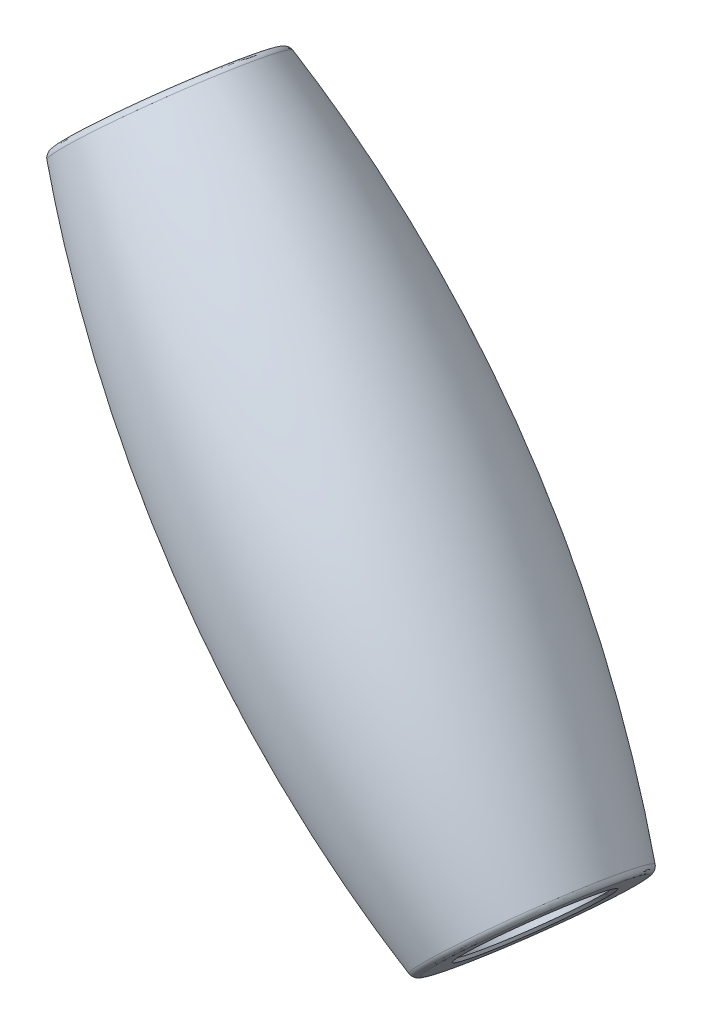
ISO-10303-21;
HEADER;
FILE_DESCRIPTION(('STEP AP214'),'2;1');
FILE_NAME('part.step','',(''),(''),'','','');
FILE_SCHEMA(('AUTOMOTIVE_DESIGN { 1 0 10303 214 1 1 1 1 }'));
ENDSEC;
DATA;
#1=APPLICATION_CONTEXT('core data for automotive mechanical design processes');
#2=APPLICATION_PROTOCOL_DEFINITION('international standard','automotive_design',2000,#1);
#3=PRODUCT_CONTEXT('',#1,'mechanical');
#4=PRODUCT('Part','Part','',(#3));
#5=PRODUCT_RELATED_PRODUCT_CATEGORY('part','',(#4));
#6=PRODUCT_DEFINITION_FORMATION('','',#4);
#7=PRODUCT_DEFINITION_CONTEXT('part definition',#1,'design');
#8=PRODUCT_DEFINITION('design','',#6,#7);
#9=PRODUCT_DEFINITION_SHAPE('','',#8);
#10=(LENGTH_UNIT() NAMED_UNIT(*) SI_UNIT(.MILLI.,.METRE.));
#11=(NAMED_UNIT(*) PLANE_ANGLE_UNIT() SI_UNIT($,.RADIAN.));
#12=(NAMED_UNIT(*) SI_UNIT($,.STERADIAN.) SOLID_ANGLE_UNIT());
#13=UNCERTAINTY_MEASURE_WITH_UNIT(LENGTH_MEASURE(1.E-05),#10,'distance_accuracy_value','');
#14=(GEOMETRIC_REPRESENTATION_CONTEXT(3) GLOBAL_UNCERTAINTY_ASSIGNED_CONTEXT((#13)) GLOBAL_UNIT_ASSIGNED_CONTEXT((#10,
#11,#12)) REPRESENTATION_CONTEXT('',''));
#15=CARTESIAN_POINT('',(0.,0.,0.));
#16=DIRECTION('',(0.,0.,1.));
#17=DIRECTION('',(1.,0.,0.));
#18=AXIS2_PLACEMENT_3D('',#15,#16,#17);
#19=CARTESIAN_POINT('',(23.35400207298,6.307790411449,-36.77943866619));
#20=DIRECTION('',(-0.69636424032003,0.707106781186531,-0.122787803969005));
#21=DIRECTION('',(-0.712498293208656,-0.701673843159878,0.));
#22=AXIS2_PLACEMENT_3D('',#19,#20,#21);
#23=CYLINDRICAL_SURFACE('',#22,2.75);
#24=CARTESIAN_POINT('',(20.4989086876672,9.20692821431447,-37.282868662463));
#25=DIRECTION('',(-0.69636424032003,0.707106781186531,-0.122787803969005));
#26=DIRECTION('',(-0.712498293208656,-0.701673843159878,0.));
#27=AXIS2_PLACEMENT_3D('',#24,#25,#26);
#28=CIRCLE('',#27,2.75);
#29=CARTESIAN_POINT('',(18.5395383813434,7.27732514562481,-37.282868662463));
#30=VERTEX_POINT('',#29);
#31=EDGE_CURVE('E94',#30,#30,#28,.T.);
#32=ORIENTED_EDGE('',*,*,#31,.F.);
#33=EDGE_LOOP('',(#32));
#34=FACE_BOUND('',#33,.T.);
#35=CARTESIAN_POINT('',(-6.52002383675149,36.6426713243534,-42.0470354564607));
#36=DIRECTION('',(-0.69636424032003,0.707106781186531,-0.122787803969005));
#37=DIRECTION('',(-0.712498293208656,-0.701673843159878,0.));
#38=AXIS2_PLACEMENT_3D('',#35,#36,#37);
#39=CIRCLE('',#38,2.75);
#40=CARTESIAN_POINT('',(-8.4793941430753,34.7130682556637,-42.0470354564607));
#41=VERTEX_POINT('',#40);
#42=EDGE_CURVE('E91',#41,#41,#39,.F.);
#43=ORIENTED_EDGE('',*,*,#42,.F.);
#44=EDGE_LOOP('',(#43));
#45=FACE_BOUND('',#44,.T.);
#46=ADVANCED_FACE('F16',(#34,#45),#23,.F.);
#47=CARTESIAN_POINT('',(20.49890868767,9.206928214314,-37.28286866247));
#48=DIRECTION('',(0.69636424032003,-0.707106781186531,0.122787803969005));
#49=DIRECTION('',(0.712498293208656,0.701673843159878,0.));
#50=AXIS2_PLACEMENT_3D('',#47,#48,#49);
#51=PLANE('',#50);
#52=ORIENTED_EDGE('',*,*,#31,.T.);
#53=EDGE_LOOP('',(#52));
#54=FACE_BOUND('',#53,.T.);
#55=CARTESIAN_POINT('',(20.4989086876644,9.20692821431726,-37.2828686624635));
#56=DIRECTION('',(0.69636424032003,-0.707106781186531,0.122787803969005));
#57=DIRECTION('',(0.712498293208656,0.701673843159878,0.));
#58=AXIS2_PLACEMENT_3D('',#55,#56,#57);
#59=CIRCLE('',#58,4.5);
#60=CARTESIAN_POINT('',(23.7051510071034,12.3644605085367,-37.2828686624635));
#61=VERTEX_POINT('',#60);
#62=EDGE_CURVE('E88',#61,#61,#59,.T.);
#63=ORIENTED_EDGE('',*,*,#62,.T.);
#64=EDGE_LOOP('',(#63));
#65=FACE_BOUND('',#64,.T.);
#66=ADVANCED_FACE('F214',(#54,#65),#51,.T.);
#67=CARTESIAN_POINT('',(-6.520023836751,36.64267132435,-42.04703545646));
#68=DIRECTION('',(-0.69636424032003,0.707106781186531,-0.122787803969005));
#69=DIRECTION('',(-0.712498293208656,-0.701673843159878,0.));
#70=AXIS2_PLACEMENT_3D('',#67,#68,#69);
#71=PLANE('',#70);
#72=ORIENTED_EDGE('',*,*,#42,.T.);
#73=EDGE_LOOP('',(#72));
#74=FACE_BOUND('',#73,.T.);
#75=CARTESIAN_POINT('',(-6.520023836748,36.6426713243523,-42.0470354564666));
#76=DIRECTION('',(-0.69636424032003,0.707106781186531,-0.122787803969005));
#77=DIRECTION('',(-0.712498293208656,-0.701673843159878,0.));
#78=AXIS2_PLACEMENT_3D('',#75,#76,#77);
#79=CIRCLE('',#78,4.5);
#80=CARTESIAN_POINT('',(-9.72626615618695,33.4851390301328,-42.0470354564666));
#81=VERTEX_POINT('',#80);
#82=EDGE_CURVE('E85',#81,#81,#79,.T.);
#83=ORIENTED_EDGE('',*,*,#82,.T.);
#84=EDGE_LOOP('',(#83));
#85=FACE_BOUND('',#84,.T.);
#86=ADVANCED_FACE('F204',(#74,#85),#71,.T.);
#87=CARTESIAN_POINT('',(23.35400207298,6.307790411449,-36.77943866619));
#88=DIRECTION('',(0.69636424032003,-0.707106781186531,0.122787803969005));
#89=DIRECTION('',(0.712498293208656,0.701673843159878,0.));
#90=AXIS2_PLACEMENT_3D('',#87,#88,#89);
#91=CYLINDRICAL_SURFACE('',#90,4.5);
#92=ORIENTED_EDGE('',*,*,#62,.F.);
#93=EDGE_LOOP('',(#92));
#94=FACE_BOUND('',#93,.T.);
#95=CARTESIAN_POINT('',(23.2147292248807,6.4492117677169,-36.8039962269907));
#96=DIRECTION('',(0.69636424032003,-0.707106781186531,0.122787803969005));
#97=DIRECTION('',(0.0861569903046802,-0.0874861007541778,-0.992432947456134));
#98=AXIS2_PLACEMENT_3D('',#95,#96,#97);
#99=CIRCLE('',#98,4.50000000003672);
#100=CARTESIAN_POINT('',(23.9961460243775,6.44921176771164,-41.2356311155543));
#101=VERTEX_POINT('',#100);
#102=CARTESIAN_POINT('',(22.4333124252791,6.44921176782527,-32.3723613385272));
#103=VERTEX_POINT('',#102);
#104=EDGE_CURVE('E73',#101,#103,#99,.T.);
#105=ORIENTED_EDGE('',*,*,#104,.T.);
#106=CARTESIAN_POINT('',(23.2147292248807,6.4492117677169,-36.8039962269907));
#107=DIRECTION('',(0.69636424032003,-0.707106781186531,0.122787803969005));
#108=DIRECTION('',(0.0861569903046802,-0.0874861007541778,-0.992432947456134));
#109=AXIS2_PLACEMENT_3D('',#106,#107,#108);
#110=CIRCLE('',#109,4.50000000003672);
#111=EDGE_CURVE('E75',#103,#101,#110,.T.);
#112=ORIENTED_EDGE('',*,*,#111,.T.);
#113=EDGE_LOOP('',(#105,#112));
#114=FACE_BOUND('',#113,.T.);
#115=ADVANCED_FACE('F201',(#94,#114),#91,.F.);
#116=CARTESIAN_POINT('',(-9.375117222063,39.54180912722,-42.55046545274));
#117=DIRECTION('',(-0.69636424032003,0.707106781186531,-0.122787803969005));
#118=DIRECTION('',(-0.712498293208656,-0.701673843159878,0.));
#119=AXIS2_PLACEMENT_3D('',#116,#117,#118);
#120=CYLINDRICAL_SURFACE('',#119,4.5);
#121=ORIENTED_EDGE('',*,*,#82,.F.);
#122=EDGE_LOOP('',(#121));
#123=FACE_BOUND('',#122,.T.);
#124=CARTESIAN_POINT('',(-9.23584437399312,39.4003877709689,-42.5259078919436));
#125=DIRECTION('',(-0.69636424032003,0.707106781186531,-0.122787803969005));
#126=DIRECTION('',(0.0861569903103945,-0.08748610074855,-0.992432947456134));
#127=AXIS2_PLACEMENT_3D('',#124,#125,#126);
#128=CIRCLE('',#127,4.50000000000432);
#129=CARTESIAN_POINT('',(-8.84813791759598,39.0067003176,-46.9918561555005));
#130=VERTEX_POINT('',#129);
#131=EDGE_CURVE('E68',#130,#130,#128,.T.);
#132=ORIENTED_EDGE('',*,*,#131,.T.);
#133=EDGE_LOOP('',(#132));
#134=FACE_BOUND('',#133,.T.);
#135=ADVANCED_FACE('F203',(#123,#134),#120,.F.);
#136=CARTESIAN_POINT('',(23.3540020728644,6.30779041156115,-36.7794386662111));
#137=DIRECTION('',(0.69636424032003,-0.707106781186531,0.122787803969006));
#138=DIRECTION('',(0.712498293208656,0.701673843159877,0.));
#139=AXIS2_PLACEMENT_3D('',#136,#137,#138);
#140=CONICAL_SURFACE('',#139,4.69999999988672,0.785398163364955);
#141=ORIENTED_EDGE('',*,*,#104,.F.);
#142=DIRECTION('',(-0.615191680475335,0.499999999999894,0.60954015148638));
#143=VECTOR('',#142,1.);
#144=CARTESIAN_POINT('',(499193.449873884,-405695.927437788,-494625.011873929));
#145=LINE('',#144,#143);
#146=CARTESIAN_POINT('',(24.1701485079852,6.30779041147593,-41.4080351053603));
#147=VERTEX_POINT('',#146);
#148=EDGE_CURVE('E71',#101,#147,#145,.F.);
#149=ORIENTED_EDGE('',*,*,#148,.T.);
#150=CARTESIAN_POINT('',(23.3540020729642,6.30779041145988,-36.7794386661935));
#151=DIRECTION('',(0.69636424032003,-0.707106781186531,0.122787803969006));
#152=DIRECTION('',(0.712498293208656,0.701673843159877,0.));
#153=AXIS2_PLACEMENT_3D('',#150,#151,#152);
#154=CIRCLE('',#153,4.70000000002994);
#155=CARTESIAN_POINT('',(22.537855637905,6.3077904114617,-32.1508422269821));
#156=VERTEX_POINT('',#155);
#157=EDGE_CURVE('E62',#156,#147,#154,.F.);
#158=ORIENTED_EDGE('',*,*,#157,.F.);
#159=DIRECTION('',(-0.369616072538232,0.499999999999016,-0.783188329153593));
#160=VECTOR('',#159,1.);
#161=CARTESIAN_POINT('',(299930.671465759,-405695.927437075,635450.36064241));
#162=LINE('',#161,#160);
#163=EDGE_CURVE('E57',#156,#103,#162,.T.);
#164=ORIENTED_EDGE('',*,*,#163,.T.);
#165=EDGE_LOOP('',(#141,#149,#158,#164));
#166=FACE_BOUND('',#165,.T.);
#167=ADVANCED_FACE('F72',(#166),#140,.F.);
#168=CARTESIAN_POINT('',(23.3540020728644,6.30779041156115,-36.7794386662111));
#169=DIRECTION('',(0.69636424032003,-0.707106781186531,0.122787803969006));
#170=DIRECTION('',(0.712498293208656,0.701673843159877,0.));
#171=AXIS2_PLACEMENT_3D('',#168,#169,#170);
#172=CONICAL_SURFACE('',#171,4.69999999988672,0.78539816334867);
#173=ORIENTED_EDGE('',*,*,#111,.F.);
#174=ORIENTED_EDGE('',*,*,#163,.F.);
#175=CARTESIAN_POINT('',(23.3540020729496,6.30779041147463,-36.7794386661961));
#176=DIRECTION('',(0.69636424032003,-0.707106781186531,0.122787803969006));
#177=DIRECTION('',(0.712498293208656,0.701673843159877,0.));
#178=AXIS2_PLACEMENT_3D('',#175,#176,#177);
#179=CIRCLE('',#178,4.70000000000907);
#180=EDGE_CURVE('E66',#147,#156,#179,.F.);
#181=ORIENTED_EDGE('',*,*,#180,.F.);
#182=ORIENTED_EDGE('',*,*,#148,.F.);
#183=EDGE_LOOP('',(#173,#174,#181,#182));
#184=FACE_BOUND('',#183,.T.);
#185=ADVANCED_FACE('F77',(#184),#172,.F.);
#186=CARTESIAN_POINT('',(-9.37511722202455,39.5418091271731,-42.5504654527317));
#187=DIRECTION('',(-0.69636424032003,0.707106781186531,-0.122787803969005));
#188=DIRECTION('',(-0.712498293208656,-0.701673843159878,0.));
#189=AXIS2_PLACEMENT_3D('',#186,#187,#188);
#190=CONICAL_SURFACE('',#189,4.69999999995667,0.785398163418359);
#191=ORIENTED_EDGE('',*,*,#131,.F.);
#192=EDGE_LOOP('',(#191));
#193=FACE_BOUND('',#192,.T.);
#194=CARTESIAN_POINT('',(-9.37511722206042,39.5418091272095,-42.550465452738));
#195=DIRECTION('',(-0.69636424032003,0.707106781186531,-0.122787803969005));
#196=DIRECTION('',(-0.712498293208656,-0.701673843159878,0.));
#197=AXIS2_PLACEMENT_3D('',#194,#195,#196);
#198=CIRCLE('',#197,4.70000000000819);
#199=CARTESIAN_POINT('',(-12.7238592001469,36.2439420643523,-42.550465452738));
#200=VERTEX_POINT('',#199);
#201=EDGE_CURVE('E78',#200,#200,#198,.T.);
#202=ORIENTED_EDGE('',*,*,#201,.T.);
#203=EDGE_LOOP('',(#202));
#204=FACE_BOUND('',#203,.T.);
#205=ADVANCED_FACE('F263',(#193,#204),#190,.F.);
#206=CARTESIAN_POINT('',(23.35400207298,6.307790411449,-36.77943866619));
#207=DIRECTION('',(0.69636424032003,-0.707106781186531,0.122787803969005));
#208=DIRECTION('',(0.712498293208656,0.701673843159878,0.));
#209=AXIS2_PLACEMENT_3D('',#206,#207,#208);
#210=PLANE('',#209);
#211=ORIENTED_EDGE('',*,*,#157,.T.);
#212=ORIENTED_EDGE('',*,*,#180,.T.);
#213=EDGE_LOOP('',(#211,#212));
#214=FACE_BOUND('',#213,.T.);
#215=CARTESIAN_POINT('',(22.22674071889,6.30779041144502,-30.38642184281));
#216=CARTESIAN_POINT('',(22.3007076558877,6.38289880496775,-30.3733771882028));
#217=CARTESIAN_POINT('',(22.3751279307511,6.45800706292176,-30.3629043211006));
#218=CARTESIAN_POINT('',(22.5246944918361,6.60804270897069,-30.3471175899189));
#219=CARTESIAN_POINT('',(22.5998407780577,6.68297009706561,-30.3418037258394));
#220=CARTESIAN_POINT('',(22.7506786974862,6.83246340467471,-30.3363504287164));
#221=CARTESIAN_POINT('',(22.826370330693,6.90702932418888,-30.3362109956728));
#222=CARTESIAN_POINT('',(22.9781164972803,7.05562008347817,-30.341106192773));
#223=CARTESIAN_POINT('',(23.0541710306608,7.12964492325329,-30.3461408229167));
#224=CARTESIAN_POINT('',(23.2064598020998,7.27697518413051,-30.3613722060972));
#225=CARTESIAN_POINT('',(23.2826940401584,7.35028060523263,-30.3715689591339));
#226=CARTESIAN_POINT('',(23.4351585588862,7.49599543135506,-30.3970999727016));
#227=CARTESIAN_POINT('',(23.5113888395555,7.56840483637539,-30.4124342332327));
#228=CARTESIAN_POINT('',(23.663661799987,7.71215318926058,-30.4482033337513));
#229=CARTESIAN_POINT('',(23.7397044797491,7.78349213712545,-30.4686381737388));
#230=CARTESIAN_POINT('',(23.8914190443797,7.92492771405295,-30.5145592002231));
#231=CARTESIAN_POINT('',(23.9670909292482,7.99502434311558,-30.5400453867199));
#232=CARTESIAN_POINT('',(24.1178816040294,8.13380641348539,-30.5960077087392));
#233=CARTESIAN_POINT('',(24.1930003939422,8.20249185479257,-30.6264838442618));
#234=CARTESIAN_POINT('',(24.3425039110309,8.33828608041634,-30.6923526443923));
#235=CARTESIAN_POINT('',(24.4168886382068,8.40539486473293,-30.7277453090002));
#236=CARTESIAN_POINT('',(24.5647448305085,8.53787410543365,-30.8033619033423));
#237=CARTESIAN_POINT('',(24.6382162956343,8.60324456181777,-30.8435858330764));
#238=CARTESIAN_POINT('',(24.7840689646383,8.73208966349899,-30.9287680546821));
#239=CARTESIAN_POINT('',(24.8564501685165,8.79556430879609,-30.9737263465537));
#240=CARTESIAN_POINT('',(24.9999479423661,8.92046487232284,-31.0682689839764));
#241=CARTESIAN_POINT('',(25.0710645123374,8.98189079055249,-31.1178533295275));
#242=CARTESIAN_POINT('',(25.2118616923269,9.10254591952712,-31.2215286212764));
#243=CARTESIAN_POINT('',(25.281542302345,9.16177513027208,-31.2756195674742));
#244=CARTESIAN_POINT('',(25.4192996957353,9.27789415592076,-31.3881777506896));
#245=CARTESIAN_POINT('',(25.4873764791075,9.33478397082447,-31.4466449877072));
#246=CARTESIAN_POINT('',(25.6217622162719,9.44608715224359,-31.567814899867));
#247=CARTESIAN_POINT('',(25.6880711700641,9.500500518759,-31.6305175750093));
#248=CARTESIAN_POINT('',(25.8187615039909,9.60671971683551,-31.7600073071819));
#249=CARTESIAN_POINT('',(25.8831428841255,9.65852554839662,-31.8267943642123));
#250=CARTESIAN_POINT('',(26.0098229703532,9.75940487177866,-31.9642919642909));
#251=CARTESIAN_POINT('',(26.0721216764463,9.80847836359959,-32.0350025073392));
#252=CARTESIAN_POINT('',(26.1944863315512,9.90377478516114,-32.1801767315618));
#253=CARTESIAN_POINT('',(26.2545522805631,9.94999771490176,-32.2546404127363));
#254=CARTESIAN_POINT('',(26.3723067173733,10.0394816572163,-32.4071415236811));
#255=CARTESIAN_POINT('',(26.4299952051717,10.0827426697902,-32.4851789534515));
#256=CARTESIAN_POINT('',(26.5428557429348,10.1661985582029,-32.6446395625847));
#257=CARTESIAN_POINT('',(26.5980277928996,10.2063934340416,-32.7260627419474));
#258=CARTESIAN_POINT('',(26.7057225406948,10.2836202160072,-32.8920986946945));
#259=CARTESIAN_POINT('',(26.7582452385251,10.3206521221342,-32.9767114680787));
#260=CARTESIAN_POINT('',(26.8605147502719,10.3914637515708,-33.1489227692864));
#261=CARTESIAN_POINT('',(26.9102615641884,10.4252434748805,-33.2365212971098));
#262=CARTESIAN_POINT('',(27.0068594636753,10.4894693603705,-33.4144930746696));
#263=CARTESIAN_POINT('',(27.0537105492457,10.5199155225508,-33.504866324406));
#264=CARTESIAN_POINT('',(27.1444041236719,10.5774009383104,-33.6881698287173));
#265=CARTESIAN_POINT('',(27.1882466125276,10.6044401918898,-33.7811000832922));
#266=CARTESIAN_POINT('',(27.2728173731284,10.6550466505174,-33.9692937201576));
#267=CARTESIAN_POINT('',(27.3135456448735,10.6786138555657,-34.0645571024481));
#268=CARTESIAN_POINT('',(27.3917898532791,10.7222194416698,-34.2571874969125));
#269=CARTESIAN_POINT('',(27.4293057899396,10.7422578227257,-34.3545545090865));
#270=CARTESIAN_POINT('',(27.5010349489986,10.77875748663,-34.5511575976574));
#271=CARTESIAN_POINT('',(27.5352481713971,10.7952187694785,-34.6503936740543));
#272=CARTESIAN_POINT('',(27.6002894792827,10.8245245802957,-34.8504958226708));
#273=CARTESIAN_POINT('',(27.6311175647697,10.8373691082644,-34.9513618948904));
#274=CARTESIAN_POINT('',(27.689314331274,10.8594104657294,-35.1544810399496));
#275=CARTESIAN_POINT('',(27.7166830122914,10.8686072952255,-35.2567341127892));
#276=CARTESIAN_POINT('',(27.7678950363066,10.8833310997775,-35.4623809224795));
#277=CARTESIAN_POINT('',(27.7917383793045,10.8888580748332,-35.5657746593303));
#278=CARTESIAN_POINT('',(27.8358422865792,10.8962288555373,-35.7734537124747));
#279=CARTESIAN_POINT('',(27.856102850856,10.8980726611857,-35.8777390287684));
#280=CARTESIAN_POINT('',(27.8929923912144,10.8980726611856,-36.0869500083373));
#281=CARTESIAN_POINT('',(27.909621367296,10.8962288555372,-36.1918756716126));
#282=CARTESIAN_POINT('',(27.9392076706043,10.888858074833,-36.4021145700315));
#283=CARTESIAN_POINT('',(27.952164997831,10.8833310997772,-36.5074278051751));
#284=CARTESIAN_POINT('',(27.974376788093,10.8686072952252,-36.718188138523));
#285=CARTESIAN_POINT('',(27.9836312511284,10.859410465729,-36.8236352367273));
#286=CARTESIAN_POINT('',(27.9984150181959,10.837369108264,-37.0344092649006));
#287=CARTESIAN_POINT('',(28.003944322228,10.8245245802952,-37.1397361948698));
#288=CARTESIAN_POINT('',(28.0112644507112,10.7952187694779,-37.3500161447732));
#289=CARTESIAN_POINT('',(28.0130552751624,10.7787574866294,-37.4549691647074));
#290=CARTESIAN_POINT('',(28.0128941302306,10.7422578227249,-37.6642484535231));
#291=CARTESIAN_POINT('',(28.0109421608478,10.722219441669,-37.7685747224046));
#292=CARTESIAN_POINT('',(28.0033001307133,10.6786138555648,-37.9763491779952));
#293=CARTESIAN_POINT('',(27.9976100699617,10.6550466505165,-38.0797973647043));
#294=CARTESIAN_POINT('',(27.9825055649445,10.6044401918888,-38.2855664402074));
#295=CARTESIAN_POINT('',(27.9730911206789,10.5774009383094,-38.3878873290014));
#296=CARTESIAN_POINT('',(27.9505605288545,10.5199155225497,-38.5911553086908));
#297=CARTESIAN_POINT('',(27.9374443812957,10.4894693603694,-38.6921023995862));
#298=CARTESIAN_POINT('',(27.9075419808333,10.4252434748793,-38.8923795930947));
#299=CARTESIAN_POINT('',(27.8907557279297,10.3914637515695,-38.9917096957078));
#300=CARTESIAN_POINT('',(27.8535535563311,10.3206521221328,-39.188513617734));
#301=CARTESIAN_POINT('',(27.8331376376362,10.2836202160058,-39.2859874371472));
#302=CARTESIAN_POINT('',(27.7887253181913,10.2063934340401,-39.4788439698049));
#303=CARTESIAN_POINT('',(27.7647289174414,10.1661985582014,-39.5742266830496));
#304=CARTESIAN_POINT('',(27.713213443318,10.0827426697887,-39.7626712180595));
#305=CARTESIAN_POINT('',(27.6856943699444,10.0394816572147,-39.8557330398248));
#306=CARTESIAN_POINT('',(27.6271998464316,9.94999771490012,-40.0393115977963));
#307=CARTESIAN_POINT('',(27.5962243962924,9.90377478515947,-40.1298283340025));
#308=CARTESIAN_POINT('',(27.5308917418211,9.80847836359786,-40.3080986581097));
#309=CARTESIAN_POINT('',(27.4965345374888,9.7594048717769,-40.3958522460109));
#310=CARTESIAN_POINT('',(27.4245211441459,9.65852554839481,-40.5683848674285));
#311=CARTESIAN_POINT('',(27.3868649551353,9.60671971683368,-40.6531639009451));
#312=CARTESIAN_POINT('',(27.308344309493,9.50050051875712,-40.819543173476));
#313=CARTESIAN_POINT('',(27.2674798528615,9.4460871522417,-40.9011434124904));
#314=CARTESIAN_POINT('',(27.1826411180329,9.33478397082254,-41.0609685138941));
#315=CARTESIAN_POINT('',(27.1386668398358,9.27789415591881,-41.1391933762833));
#316=CARTESIAN_POINT('',(27.047714399764,9.1617751302701,-41.2920792738913));
#317=CARTESIAN_POINT('',(27.0007362378892,9.10254591952511,-41.3667403091101));
#318=CARTESIAN_POINT('',(26.9038892049689,8.98189079055047,-41.5123186874041));
#319=CARTESIAN_POINT('',(26.8540203339233,8.92046487232081,-41.5832360304793));
#320=CARTESIAN_POINT('',(26.7515120211394,8.79556430879404,-41.7211561783939));
#321=CARTESIAN_POINT('',(26.698872579401,8.73208966349693,-41.7881589832332));
#322=CARTESIAN_POINT('',(26.5909499382583,8.6032445618157,-41.9180886390553));
#323=CARTESIAN_POINT('',(26.5356667388541,8.53787410543157,-41.981015490038));
#324=CARTESIAN_POINT('',(26.4225897644453,8.40539486473085,-42.1026416418327));
#325=CARTESIAN_POINT('',(26.3647959894408,8.33828608041425,-42.1613409426446));
#326=CARTESIAN_POINT('',(26.2468370941123,8.20249185479048,-42.2743705824095));
#327=CARTESIAN_POINT('',(26.1866719737883,8.13380641348331,-42.3287009213625));
#328=CARTESIAN_POINT('',(26.064115330811,7.9950243431135,-42.4328617506068));
#329=CARTESIAN_POINT('',(26.0017238081576,7.92492771405087,-42.4826922408982));
#330=CARTESIAN_POINT('',(25.8748646673683,7.78349213712339,-42.5777333277638));
#331=CARTESIAN_POINT('',(25.8103970492324,7.71215318925853,-42.622943924338));
#332=CARTESIAN_POINT('',(25.6795410248557,7.56840483637336,-42.7086363038987));
#333=CARTESIAN_POINT('',(25.613152618615,7.49599543135305,-42.7491180868852));
#334=CARTESIAN_POINT('',(25.4786149563544,7.35028060523064,-42.8252553284832));
#335=CARTESIAN_POINT('',(25.4104657003346,7.27697518412854,-42.8609107870949));
#336=CARTESIAN_POINT('',(25.2725705054433,7.12964492325135,-42.9273094329082));
#337=CARTESIAN_POINT('',(25.2028245665717,7.05562008347626,-42.95805262011));
#338=CARTESIAN_POINT('',(25.0619040696109,6.90702932418701,-43.0145528463475));
#339=CARTESIAN_POINT('',(24.9907295115217,6.83246340467286,-43.0403098853832));
#340=CARTESIAN_POINT('',(24.8471230942365,6.68297009706381,-43.0867750691394));
#341=CARTESIAN_POINT('',(24.7746912350405,6.60804270896892,-43.10748321386));
#342=CARTESIAN_POINT('',(24.6287452612112,6.45800706292005,-43.1438033157211));
#343=CARTESIAN_POINT('',(24.5552311465779,6.38289880496606,-43.1594152728617));
#344=CARTESIAN_POINT('',(24.4812634270606,6.30779041144336,-43.1724554895799));
#345=B_SPLINE_CURVE_WITH_KNOTS('',3,(#215,#216,#217,#218,#219,#220,#221,#222,#223,#224,#225,
#226,#227,#228,#229,#230,#231,#232,#233,#234,#235,#236,#237,#238,#239,#240,#241,#242,#243,#244,
#245,#246,#247,#248,#249,#250,#251,#252,#253,#254,#255,#256,#257,#258,#259,#260,#261,#262,#263,
#264,#265,#266,#267,#268,#269,#270,#271,#272,#273,#274,#275,#276,#277,#278,#279,#280,#281,#282,
#283,#284,#285,#286,#287,#288,#289,#290,#291,#292,#293,#294,#295,#296,#297,#298,#299,#300,#301,
#302,#303,#304,#305,#306,#307,#308,#309,#310,#311,#312,#313,#314,#315,#316,#317,#318,#319,#320,
#321,#322,#323,#324,#325,#326,#327,#328,#329,#330,#331,#332,#333,#334,#335,#336,#337,#338,#339,
#340,#341,#342,#343,#344),.UNSPECIFIED.,.F.,.F.,(4,2,2,2,2,2,2,2,2,2,2,2,2,2,2,2,2,2,2,2,2,2,2,
2,2,2,2,2,2,2,2,2,2,2,2,2,2,2,2,2,2,2,2,2,2,2,2,2,2,2,2,2,2,2,2,2,2,2,2,2,2,2,2,2,4),(0.,
0.318625612631008,0.637251225262015,0.955876837893021,1.27450245052403,1.59312806315503,
1.91175367578603,2.23037928841702,2.54900490104802,2.86763051367901,3.18625612631001,
3.50488173894099,3.82350735157198,4.14213296420296,4.46075857683395,4.77938418946493,
5.09800980209591,5.41663541472688,5.73526102735786,6.05388663998883,6.37251225261979,
6.69113786525077,7.00976347788173,7.3283890905127,7.64701470314366,7.96564031577462,
8.28426592840558,8.60289154103653,8.92151715366749,9.24014276629844,9.55876837892939,
9.87739399156033,10.1960196041913,10.5146452168222,10.8332708294532,11.1518964420841,
11.470522054715,11.789147667346,12.1077732799769,12.4263988926078,12.7450245052388,
13.0636501178697,13.3822757305006,13.7009013431315,14.0195269557625,14.3381525683934,
14.6567781810243,14.9754037936552,15.2940294062861,15.612655018917,15.9312806315479,
16.2499062441788,16.5685318568097,16.8871574694406,17.2057830820715,17.5244086947024,
17.8430343073333,18.1616599199642,18.4802855325951,18.798911145226,19.1175367578569,
19.4361623704878,19.7547879831187,20.0734135957495,20.3920392083804),.UNSPECIFIED.);
#346=CARTESIAN_POINT('',(22.2267407194853,6.30779041204929,-30.3864218427051));
#347=VERTEX_POINT('',#346);
#348=CARTESIAN_POINT('',(24.4812634266426,6.30779041101835,-43.1724554896552));
#349=VERTEX_POINT('',#348);
#350=EDGE_CURVE('E81',#347,#349,#345,.T.);
#351=ORIENTED_EDGE('',*,*,#350,.F.);
#352=CARTESIAN_POINT('',(23.35400207298,6.30779041144873,-36.7794386661955));
#353=DIRECTION('',(-0.69636424032003,0.707106781186531,-0.122787803969005));
#354=DIRECTION('',(0.17364817750502,-1.64450605373756E-10,-0.984807753040757));
#355=AXIS2_PLACEMENT_3D('',#352,#353,#354);
#356=CIRCLE('',#355,6.49163941269943);
#357=EDGE_CURVE('E170',#349,#347,#356,.T.);
#358=ORIENTED_EDGE('',*,*,#357,.F.);
#359=EDGE_LOOP('',(#351,#358));
#360=FACE_BOUND('',#359,.T.);
#361=ADVANCED_FACE('F64',(#214,#360),#210,.T.);
#362=CARTESIAN_POINT('',(-9.375117222063,39.54180912722,-42.55046545274));
#363=DIRECTION('',(0.69636424032003,-0.707106781186531,0.122787803969005));
#364=DIRECTION('',(0.712498293208656,0.701673843159878,0.));
#365=AXIS2_PLACEMENT_3D('',#362,#363,#364);
#366=PLANE('',#365);
#367=ORIENTED_EDGE('',*,*,#201,.F.);
#368=EDGE_LOOP('',(#367));
#369=FACE_BOUND('',#368,.T.);
#370=CARTESIAN_POINT('',(-9.37511722206302,39.5418091272133,-42.5504654527345));
#371=DIRECTION('',(0.69636424032003,-0.707106781186531,0.122787803969005));
#372=DIRECTION('',(-0.173648177180735,4.93738158280425E-10,0.984807753097937));
#373=AXIS2_PLACEMENT_3D('',#370,#371,#372);
#374=CIRCLE('',#373,6.48880490282299);
#375=CARTESIAN_POINT('',(-10.5018863674109,39.5418091284998,-36.1602400764276));
#376=VERTEX_POINT('',#375);
#377=CARTESIAN_POINT('',(-8.2483480754498,39.5418091272177,-48.9406908288189));
#378=VERTEX_POINT('',#377);
#379=EDGE_CURVE('E35',#376,#378,#374,.T.);
#380=ORIENTED_EDGE('',*,*,#379,.F.);
#381=CARTESIAN_POINT('',(-8.24834807544818,39.5418091272161,-48.9406908288193));
#382=CARTESIAN_POINT('',(-8.17441265320113,39.6168847254047,-48.9276563059821));
#383=CARTESIAN_POINT('',(-8.10093063777595,39.6919601880838,-48.9120511656473));
#384=CARTESIAN_POINT('',(-7.9550483898068,39.8419303225578,-48.8757469225976));
#385=CARTESIAN_POINT('',(-7.88264815726284,39.9168249943528,-48.8550478198826));
#386=CARTESIAN_POINT('',(-7.73910444429364,40.0662530271937,-48.8086029246869));
#387=CARTESIAN_POINT('',(-7.6679609638684,40.1407863882396,-48.7828571322063));
#388=CARTESIAN_POINT('',(-7.52710199844321,40.2893122668494,-48.7263815762311));
#389=CARTESIAN_POINT('',(-7.45738651344326,40.3633047844133,-48.6956518127366));
#390=CARTESIAN_POINT('',(-7.31955152911941,40.5105707149952,-48.6292821592321));
#391=CARTESIAN_POINT('',(-7.25143202979552,40.5838441280132,-48.5936422692223));
#392=CARTESIAN_POINT('',(-7.11695311206923,40.7294953292038,-48.5175382721943));
#393=CARTESIAN_POINT('',(-7.05059369366684,40.8018731173765,-48.4770741651762));
#394=CARTESIAN_POINT('',(-6.91979480627379,40.9455587039708,-48.3914192023417));
#395=CARTESIAN_POINT('',(-6.85535533728315,41.0168665023926,-48.3462283465253));
#396=CARTESIAN_POINT('',(-6.72855158827795,41.1582403228799,-48.2512287584061));
#397=CARTESIAN_POINT('',(-6.6661873082634,41.2283063449456,-48.2014200261033));
#398=CARTESIAN_POINT('',(-6.54368417842724,41.3670278175025,-48.0973046776503));
#399=CARTESIAN_POINT('',(-6.48354532860562,41.4356832679938,-48.0429980615002));
#400=CARTESIAN_POINT('',(-6.36563793885748,41.5714182004174,-47.9300177750048));
#401=CARTESIAN_POINT('',(-6.30786939893095,41.6384976823498,-47.8713441046595));
#402=CARTESIAN_POINT('',(-6.19484179846022,41.7709190773056,-47.7497710597159));
#403=CARTESIAN_POINT('',(-6.13958273791602,41.8362609903291,-47.6868716851176));
#404=CARTESIAN_POINT('',(-6.03170722012299,41.9650498330761,-47.5569987617891));
#405=CARTESIAN_POINT('',(-5.97909076287417,42.0284967627997,-47.490025213059));
#406=CARTESIAN_POINT('',(-5.87662720932713,42.1533427897357,-47.3521652866071));
#407=CARTESIAN_POINT('',(-5.8267801130289,42.2147418869481,-47.2812789088854));
#408=CARTESIAN_POINT('',(-5.72997536740385,42.3353443330588,-47.1357640959443));
#409=CARTESIAN_POINT('',(-5.68301771807702,42.394547681957,-47.0611356607251));
#410=CARTESIAN_POINT('',(-5.59210499148506,42.5106160053863,-46.9083165192258));
#411=CARTESIAN_POINT('',(-5.54814991421993,42.5674809799172,-46.8301258129458));
#412=CARTESIAN_POINT('',(-5.46334822338248,42.6787355619075,-46.6703704975853));
#413=CARTESIAN_POINT('',(-5.42250160981017,42.7331251693667,-46.5888058885048));
#414=CARTESIAN_POINT('',(-5.3440152494282,42.8392979878852,-46.4224992638307));
#415=CARTESIAN_POINT('',(-5.30637550261855,42.8910811989444,-46.3377572482372));
#416=CARTESIAN_POINT('',(-5.23439355320883,42.9919164743717,-46.1652999614751));
#417=CARTESIAN_POINT('',(-5.20005135060875,43.0409685387397,-46.0775846903066));
#418=CARTESIAN_POINT('',(-5.13474722299226,43.1362233500651,-45.8993922061659));
#419=CARTESIAN_POINT('',(-5.10378529797585,43.1824260970225,-45.8089149931936));
#420=CARTESIAN_POINT('',(-5.045316315516,43.2718709670622,-45.6254165929763));
#421=CARTESIAN_POINT('',(-5.01780925807256,43.3151130901446,-45.5323954057312));
#422=CARTESIAN_POINT('',(-4.96631627766936,43.3985325383723,-45.344033153156));
#423=CARTESIAN_POINT('',(-4.94233035470961,43.4387098635177,-45.2486920878258));
#424=CARTESIAN_POINT('',(-4.89793742746312,43.5159029251759,-45.0559197640577));
#425=CARTESIAN_POINT('',(-4.87753042317638,43.5529186616888,-44.9584885056198));
#426=CARTESIAN_POINT('',(-4.84034449553669,43.6236993719306,-44.7617705160716));
#427=CARTESIAN_POINT('',(-4.82356557218373,43.6574643456596,-44.6624837849614));
#428=CARTESIAN_POINT('',(-4.79367622830762,43.7216621875545,-44.4622940405005));
#429=CARTESIAN_POINT('',(-4.78056580778446,43.7520950557204,-44.3613910271498));
#430=CARTESIAN_POINT('',(-4.75804505371933,43.8095553710442,-44.158211802405));
#431=CARTESIAN_POINT('',(-4.74863472017736,43.836582818202,-44.055935591011));
#432=CARTESIAN_POINT('',(-4.73353681039233,43.887167180022,-43.8502563625313));
#433=CARTESIAN_POINT('',(-4.72784923414929,43.9107240946842,-43.7468533454455));
#434=CARTESIAN_POINT('',(-4.72021054083147,43.9543106408422,-43.5391696125076));
#435=CARTESIAN_POINT('',(-4.71825942375669,43.9743402723381,-43.4348888966553));
#436=CARTESIAN_POINT('',(-4.71809834918734,44.0108239990267,-43.2257009875627));
#437=CARTESIAN_POINT('',(-4.71988839169277,44.0272780942195,-43.1207937943224));
#438=CARTESIAN_POINT('',(-4.72720532391463,44.0565711089454,-42.9106056610709));
#439=CARTESIAN_POINT('',(-4.73273221363108,44.0694100284787,-42.8053247210597));
#440=CARTESIAN_POINT('',(-4.74750952551356,44.0914417618038,-42.5946427252725));
#441=CARTESIAN_POINT('',(-4.7567599476796,44.1006345755957,-42.4892416694966));
#442=CARTESIAN_POINT('',(-4.77896203938402,44.1153519511447,-42.2785733625552));
#443=CARTESIAN_POINT('',(-4.79191370892241,44.1208765129017,-42.1733061113898));
#444=CARTESIAN_POINT('',(-4.82148709366519,44.1282440752277,-41.9631590116981));
#445=CARTESIAN_POINT('',(-4.83810880886958,44.1300870757966,-41.8582791631717));
#446=CARTESIAN_POINT('',(-4.87498224177655,44.1300870757966,-41.6491595334994));
#447=CARTESIAN_POINT('',(-4.89523395947912,44.1282440752277,-41.5449197523534));
#448=CARTESIAN_POINT('',(-4.93931860922067,44.1208765129018,-41.3373313802051));
#449=CARTESIAN_POINT('',(-4.96315154125964,44.1153519511448,-41.2339827892028));
#450=CARTESIAN_POINT('',(-5.01434120405319,44.100634575596,-41.0284257731496));
#451=CARTESIAN_POINT('',(-5.04169793480777,44.0914417618041,-40.9262173480989));
#452=CARTESIAN_POINT('',(-5.09986929027195,44.069410028479,-40.7231868929972));
#453=CARTESIAN_POINT('',(-5.13068391498157,44.0565711089458,-40.6223648629463));
#454=CARTESIAN_POINT('',(-5.19569682322588,44.0272780942199,-40.4223500869459));
#455=CARTESIAN_POINT('',(-5.22989510676057,44.0108239990272,-40.3231573409963));
#456=CARTESIAN_POINT('',(-5.30159294599458,43.9743402723386,-40.1266400972116));
#457=CARTESIAN_POINT('',(-5.3390925016939,43.9543106408429,-40.0293155993765));
#458=CARTESIAN_POINT('',(-5.4173025455429,43.9107240946849,-39.8367693150608));
#459=CARTESIAN_POINT('',(-5.4580130336926,43.8871671800227,-39.7415475285802));
#460=CARTESIAN_POINT('',(-5.54254686731058,43.8365828182028,-39.5534360645974));
#461=CARTESIAN_POINT('',(-5.58637021277887,43.809555371045,-39.4605463870952));
#462=CARTESIAN_POINT('',(-5.67702418675635,43.7520950557213,-39.2773229204387));
#463=CARTESIAN_POINT('',(-5.72385481526554,43.7216621875554,-39.1869891312844));
#464=CARTESIAN_POINT('',(-5.82041053623886,43.6574643456606,-39.0090950633338));
#465=CARTESIAN_POINT('',(-5.87013562870299,43.6236993719316,-38.9215347845376));
#466=CARTESIAN_POINT('',(-5.97236048548304,43.5529186616898,-38.7493986776844));
#467=CARTESIAN_POINT('',(-6.02486024979897,43.515902925177,-38.6648228496273));
#468=CARTESIAN_POINT('',(-6.13250797375193,43.4387098635188,-38.4988593948301));
#469=CARTESIAN_POINT('',(-6.18765593338897,43.3985325383735,-38.41747176809));
#470=CARTESIAN_POINT('',(-6.30046719171901,43.3151130901459,-38.2580807858481));
#471=CARTESIAN_POINT('',(-6.35813049041201,43.2718709670635,-38.1800774303464));
#472=CARTESIAN_POINT('',(-6.47583351091671,43.1824260970239,-38.0276429074972));
#473=CARTESIAN_POINT('',(-6.53587323272841,43.1362233500665,-37.9532117401496));
#474=CARTESIAN_POINT('',(-6.65818445852182,43.0409685387412,-37.8081009048101));
#475=CARTESIAN_POINT('',(-6.72045596250352,42.9919164743732,-37.7374212368182));
#476=CARTESIAN_POINT('',(-6.84708073512949,42.891081198946,-37.5999836737011));
#477=CARTESIAN_POINT('',(-6.91143400377376,42.8392979878868,-37.5332257785759));
#478=CARTESIAN_POINT('',(-7.04206727306402,42.7331251693684,-37.4037925868088));
#479=CARTESIAN_POINT('',(-7.10834727371001,42.6787355619092,-37.3411172901669));
#480=CARTESIAN_POINT('',(-7.24267433267672,42.567480979919,-37.2200002856457));
#481=CARTESIAN_POINT('',(-7.31072139099744,42.5106160053881,-37.1615585777664));
#482=CARTESIAN_POINT('',(-7.44841863398988,42.3945476819589,-37.0490495419638));
#483=CARTESIAN_POINT('',(-7.51806881866159,42.3353443330607,-36.9949822140404));
#484=CARTESIAN_POINT('',(-7.65880452096058,42.2147418869501,-36.8913521910779));
#485=CARTESIAN_POINT('',(-7.72989003858784,42.1533427897376,-36.8417894960388));
#486=CARTESIAN_POINT('',(-7.8733251555594,42.0284967628017,-36.7472881397196));
#487=CARTESIAN_POINT('',(-7.9456747549037,41.9650498330782,-36.7023494784396));
#488=CARTESIAN_POINT('',(-8.09146373878813,41.8362609903312,-36.6172044508048));
#489=CARTESIAN_POINT('',(-8.16490312332827,41.7709190773077,-36.5769980844501));
#490=CARTESIAN_POINT('',(-8.31269475569186,41.638497682352,-36.5014145073428));
#491=CARTESIAN_POINT('',(-8.38704700351532,41.5714182004197,-36.4660372965902));
#492=CARTESIAN_POINT('',(-8.53648524137789,41.4356832679961,-36.4001972574169));
#493=CARTESIAN_POINT('',(-8.611571231417,41.3670278175048,-36.3697344289962));
#494=CARTESIAN_POINT('',(-8.76229606494746,41.2283063449479,-36.3137965423687));
#495=CARTESIAN_POINT('',(-8.83793490843882,41.1582403228823,-36.288321484162));
#496=CARTESIAN_POINT('',(-8.98958322841136,41.016866502395,-36.2424205086377));
#497=CARTESIAN_POINT('',(-9.06559270489255,40.9455587039733,-36.22199459132));
#498=CARTESIAN_POINT('',(-9.21779917684797,40.801873117379,-36.1862411090236));
#499=CARTESIAN_POINT('',(-9.29399617232221,40.7294953292063,-36.1709135440449));
#500=CARTESIAN_POINT('',(-9.44639411893202,40.5838441280158,-36.1453936783404));
#501=CARTESIAN_POINT('',(-9.52259507006758,40.5105707149978,-36.1352013776145));
#502=CARTESIAN_POINT('',(-9.67481734612687,40.363304784416,-36.1199766450659));
#503=CARTESIAN_POINT('',(-9.7508386710506,40.2893122668521,-36.1149442132432));
#504=CARTESIAN_POINT('',(-9.90251857918119,40.1407863882423,-36.1100511535819));
#505=CARTESIAN_POINT('',(-9.97817716238805,40.0662530271964,-36.1101905257433));
#506=CARTESIAN_POINT('',(-10.1289492199369,39.9168249943556,-36.1156414417379));
#507=CARTESIAN_POINT('',(-10.204062694279,39.8419303225606,-36.1209529855712));
#508=CARTESIAN_POINT('',(-10.3535639486104,39.6919601880866,-36.1367328236331));
#509=CARTESIAN_POINT('',(-10.4279517285998,39.6168847254076,-36.1472011178618));
#510=CARTESIAN_POINT('',(-10.5018863686691,39.541809127219,-36.1602400766498));
#511=B_SPLINE_CURVE_WITH_KNOTS('',3,(#381,#382,#383,#384,#385,#386,#387,#388,#389,#390,#391,
#392,#393,#394,#395,#396,#397,#398,#399,#400,#401,#402,#403,#404,#405,#406,#407,#408,#409,#410,
#411,#412,#413,#414,#415,#416,#417,#418,#419,#420,#421,#422,#423,#424,#425,#426,#427,#428,#429,
#430,#431,#432,#433,#434,#435,#436,#437,#438,#439,#440,#441,#442,#443,#444,#445,#446,#447,#448,
#449,#450,#451,#452,#453,#454,#455,#456,#457,#458,#459,#460,#461,#462,#463,#464,#465,#466,#467,
#468,#469,#470,#471,#472,#473,#474,#475,#476,#477,#478,#479,#480,#481,#482,#483,#484,#485,#486,
#487,#488,#489,#490,#491,#492,#493,#494,#495,#496,#497,#498,#499,#500,#501,#502,#503,#504,#505,
#506,#507,#508,#509,#510),.UNSPECIFIED.,.F.,.F.,(4,2,2,2,2,2,2,2,2,2,2,2,2,2,2,2,2,2,2,2,2,2,2,
2,2,2,2,2,2,2,2,2,2,2,2,2,2,2,2,2,2,2,2,2,2,2,2,2,2,2,2,2,2,2,2,2,2,2,2,2,2,2,2,2,4),(0.,
0.318486487921431,0.636972975842868,0.955459463764303,1.27394595168573,1.59243243960717,
1.9109189275286,2.22940541545003,2.54789190337146,2.86637839129289,3.18486487921431,
3.50335136713573,3.82183785505716,4.14032434297858,4.4588108309,4.77729731882141,
5.09578380674283,5.41427029466425,5.73275678258567,6.05124327050708,6.3697297584285,
6.6882162463499,7.00670273427132,7.32518922219272,7.64367571011413,7.96216219803554,
8.28064868595694,8.59913517387834,8.91762166179974,9.23610814972114,9.55459463764254,
9.87308112556394,10.1915676134853,10.5100541014067,10.8285405893281,11.1470270772495,
11.4655135651709,11.7840000530923,12.1024865410137,12.4209730289351,12.7394595168565,
13.0579460047779,13.3764324926992,13.6949189806206,14.013405468542,14.3318919564634,
14.6503784443848,14.9688649323061,15.2873514202275,15.6058379081489,15.9243243960703,
16.2428108839916,16.561297371913,16.8797838598344,17.1982703477557,17.5167568356771,
17.8352433235985,18.1537298115198,18.4722162994412,18.7907027873626,19.1091892752839,
19.4276757632053,19.7461622511266,20.064648739048,20.3831352269694),.UNSPECIFIED.);
#512=EDGE_CURVE('E98',#378,#376,#511,.T.);
#513=ORIENTED_EDGE('',*,*,#512,.F.);
#514=EDGE_LOOP('',(#380,#513));
#515=FACE_BOUND('',#514,.T.);
#516=ADVANCED_FACE('F130',(#369,#515),#366,.F.);
#517=CARTESIAN_POINT('',(23.00581995282,6.661343802042,-36.84083256818));
#518=DIRECTION('',(0.69636424032003,-0.707106781186531,0.122787803969005));
#519=DIRECTION('',(-0.154664486315135,0.0192114546164053,0.987780247162494));
#520=AXIS2_PLACEMENT_3D('',#517,#518,#519);
#521=TOROIDAL_SURFACE('',#520,6.491639412702,0.5);
#522=CARTESIAN_POINT('',(23.0885379981141,6.57734969756579,-36.8262471449977));
#523=DIRECTION('',(-0.69636424032003,0.707106781186531,-0.122787803969005));
#524=DIRECTION('',(0.173648177667226,2.57573447710963E-13,-0.984807753012156));
#525=AXIS2_PLACEMENT_3D('',#522,#523,#524);
#526=CIRCLE('',#525,6.97732447611867);
#527=CARTESIAN_POINT('',(24.3001376783851,6.57734969756758,-43.6975703843609));
#528=VERTEX_POINT('',#527);
#529=EDGE_CURVE('E27',#528,#528,#526,.F.);
#530=ORIENTED_EDGE('',*,*,#529,.T.);
#531=EDGE_LOOP('',(#530));
#532=FACE_BOUND('',#531,.T.);
#533=ORIENTED_EDGE('',*,*,#357,.T.);
#534=ORIENTED_EDGE('',*,*,#350,.T.);
#535=EDGE_LOOP('',(#533,#534));
#536=FACE_BOUND('',#535,.T.);
#537=ADVANCED_FACE('F113',(#532,#536),#521,.T.);
#538=CARTESIAN_POINT('',(-9.026935101903,39.18825573662,-42.48907155075));
#539=DIRECTION('',(0.69636424032003,-0.707106781186531,0.122787803969005));
#540=DIRECTION('',(-0.153745932232813,0.0201377494495769,0.987905187439042));
#541=AXIS2_PLACEMENT_3D('',#538,#539,#540);
#542=TOROIDAL_SURFACE('',#541,6.488804902823,0.5);
#543=ORIENTED_EDGE('',*,*,#512,.T.);
#544=ORIENTED_EDGE('',*,*,#379,.T.);
#545=EDGE_LOOP('',(#543,#544));
#546=FACE_BOUND('',#545,.T.);
#547=CARTESIAN_POINT('',(-9.10970801338255,39.2723055536822,-42.5036666483147));
#548=DIRECTION('',(-0.69636424032003,0.707106781186531,-0.122787803969005));
#549=DIRECTION('',(0.173648177667145,1.75102223728224E-13,-0.98480775301217));
#550=AXIS2_PLACEMENT_3D('',#547,#548,#549);
#551=CIRCLE('',#550,6.97447068966506);
#552=CARTESIAN_POINT('',(-7.8986038879293,39.2723055536835,-49.372179456653));
#553=VERTEX_POINT('',#552);
#554=EDGE_CURVE('E11',#553,#553,#551,.T.);
#555=ORIENTED_EDGE('',*,*,#554,.T.);
#556=EDGE_LOOP('',(#555));
#557=FACE_BOUND('',#556,.T.);
#558=ADVANCED_FACE('F102',(#546,#557),#542,.T.);
#559=CARTESIAN_POINT('',(24.59341199465,6.259985561804,-43.53318446491));
#560=CARTESIAN_POINT('',(23.6022727678,7.3332974182,-44.09311122479));
#561=CARTESIAN_POINT('',(22.45701314356,8.564769641434,-44.68978702909));
#562=CARTESIAN_POINT('',(19.12322141082,12.12139676643,-46.26471389177));
#563=CARTESIAN_POINT('',(14.47925575436,17.00311610822,-48.04017714585));
#564=CARTESIAN_POINT('',(7.390580308874,24.2598395367,-49.62810565096));
#565=CARTESIAN_POINT('',(0.8651063930367,30.77166273512,-50.1203992942));
#566=CARTESIAN_POINT('',(-4.353511035567,35.86750900445,-49.86995823027));
#567=CARTESIAN_POINT('',(-7.131528943344,38.53932502106,-49.50141098817));
#568=CARTESIAN_POINT('',(-8.22998949762,39.58924828643,-49.31799872732));
#569=(BOUNDED_CURVE() B_SPLINE_CURVE(3,(#559,#560,#561,#562,#563,#564,#565,#566,#567,#568),
.UNSPECIFIED.,.F.,.F.) B_SPLINE_CURVE_WITH_KNOTS((4,1,1,1,1,1,1,4),(0.,0.1014477399545,
0.1146764368519,0.3267895274159,0.5389026179799,0.7510157085439,0.9006865878897,1.),
.UNSPECIFIED.) CURVE() GEOMETRIC_REPRESENTATION_ITEM() RATIONAL_B_SPLINE_CURVE((1.,1.,1.,1.,1.,
1.,1.,1.,1.,1.)) REPRESENTATION_ITEM(''));
#570=CARTESIAN_POINT('',(-8.785349517508,38.94294330518,-42.44647349407));
#571=DIRECTION('',(-0.69636424032003,0.707106781186531,-0.122787803969005));
#572=AXIS1_PLACEMENT('',#570,#571);
#573=SURFACE_OF_REVOLUTION('',#569,#572);
#574=ORIENTED_EDGE('',*,*,#554,.F.);
#575=EDGE_LOOP('',(#574));
#576=FACE_BOUND('',#575,.T.);
#577=ORIENTED_EDGE('',*,*,#529,.F.);
#578=EDGE_LOOP('',(#577));
#579=FACE_BOUND('',#578,.T.);
#580=ADVANCED_FACE('F112',(#576,#579),#573,.T.);
#581=CLOSED_SHELL('',(#46,#66,#86,#115,#135,#167,#185,#205,#361,#516,#537,#558,#580));
#582=MANIFOLD_SOLID_BREP('B1',#581);
#583=ADVANCED_BREP_SHAPE_REPRESENTATION('',(#18,#582),#14);
#584=SHAPE_DEFINITION_REPRESENTATION(#9,#583);
ENDSEC;
END-ISO-10303-21;
